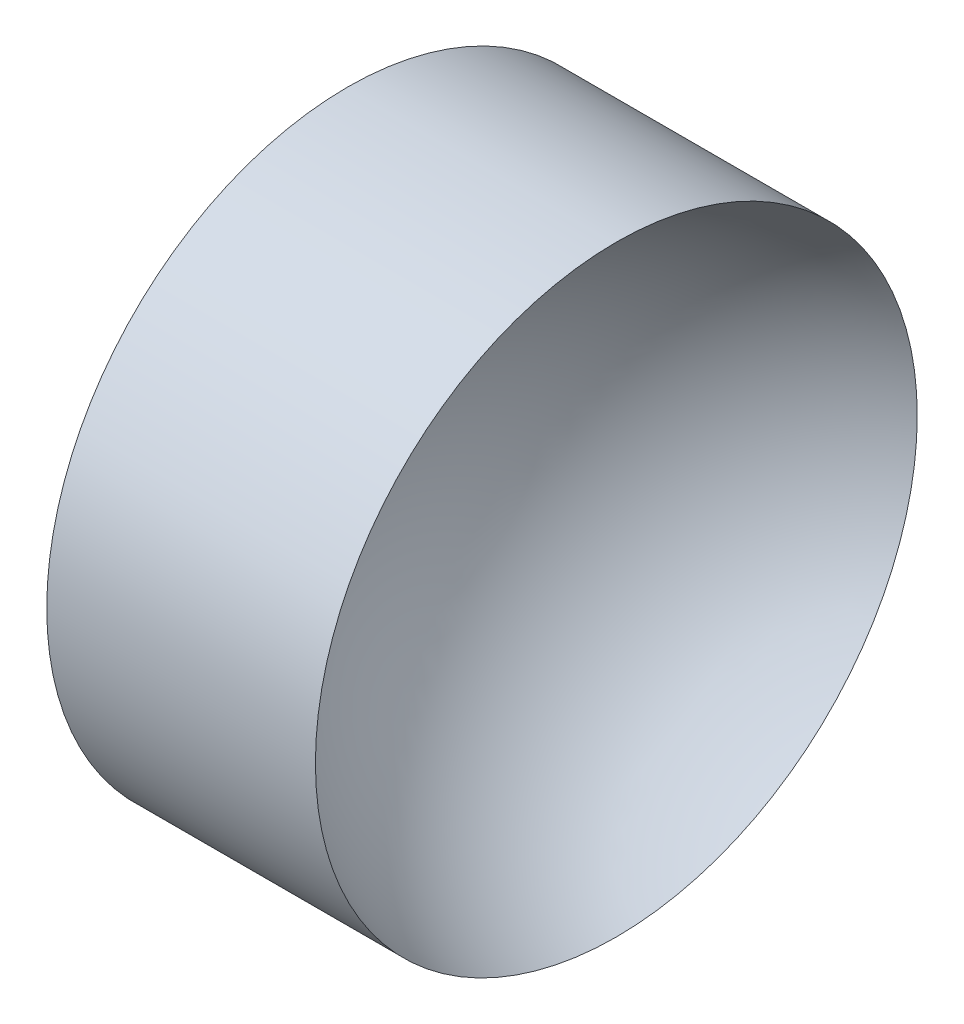
ISO-10303-21;
HEADER;
FILE_DESCRIPTION(('STEP AP214'),'2;1');
FILE_NAME('part.step','',(''),(''),'','','');
FILE_SCHEMA(('AUTOMOTIVE_DESIGN { 1 0 10303 214 1 1 1 1 }'));
ENDSEC;
DATA;
#1=APPLICATION_CONTEXT('core data for automotive mechanical design processes');
#2=APPLICATION_PROTOCOL_DEFINITION('international standard','automotive_design',2000,#1);
#3=PRODUCT_CONTEXT('',#1,'mechanical');
#4=PRODUCT('Part','Part','',(#3));
#5=PRODUCT_RELATED_PRODUCT_CATEGORY('part','',(#4));
#6=PRODUCT_DEFINITION_FORMATION('','',#4);
#7=PRODUCT_DEFINITION_CONTEXT('part definition',#1,'design');
#8=PRODUCT_DEFINITION('design','',#6,#7);
#9=PRODUCT_DEFINITION_SHAPE('','',#8);
#10=(LENGTH_UNIT() NAMED_UNIT(*) SI_UNIT(.MILLI.,.METRE.));
#11=(NAMED_UNIT(*) PLANE_ANGLE_UNIT() SI_UNIT($,.RADIAN.));
#12=(NAMED_UNIT(*) SI_UNIT($,.STERADIAN.) SOLID_ANGLE_UNIT());
#13=UNCERTAINTY_MEASURE_WITH_UNIT(LENGTH_MEASURE(1.E-05),#10,'distance_accuracy_value','');
#14=(GEOMETRIC_REPRESENTATION_CONTEXT(3) GLOBAL_UNCERTAINTY_ASSIGNED_CONTEXT((#13)) GLOBAL_UNIT_ASSIGNED_CONTEXT((#10,
#11,#12)) REPRESENTATION_CONTEXT('',''));
#15=CARTESIAN_POINT('',(0.,0.,0.));
#16=DIRECTION('',(0.,0.,1.));
#17=DIRECTION('',(1.,0.,0.));
#18=AXIS2_PLACEMENT_3D('',#15,#16,#17);
#19=CARTESIAN_POINT('',(72.6412671835305,32.6107681292268,0.));
#20=DIRECTION('',(-1.,0.,0.));
#21=DIRECTION('',(0.,-1.,0.));
#22=AXIS2_PLACEMENT_3D('',#19,#20,#21);
#23=SPHERICAL_SURFACE('',#22,13.1089301310044);
#24=CARTESIAN_POINT('',(68.6923370525261,32.6107681292268,0.));
#25=DIRECTION('',(-1.,0.,0.));
#26=DIRECTION('',(0.,0.,1.));
#27=AXIS2_PLACEMENT_3D('',#24,#25,#26);
#28=CIRCLE('',#27,12.5);
#29=CARTESIAN_POINT('',(68.6923370525261,32.6107681292268,12.5));
#30=VERTEX_POINT('',#29);
#31=EDGE_CURVE('E10',#30,#30,#28,.T.);
#32=ORIENTED_EDGE('',*,*,#31,.F.);
#33=EDGE_LOOP('',(#32));
#34=FACE_BOUND('',#33,.T.);
#35=ADVANCED_FACE('F35',(#34),#23,.F.);
#36=CARTESIAN_POINT('',(56.1009150799972,32.6107681292268,0.));
#37=DIRECTION('',(-1.,0.,0.));
#38=DIRECTION('',(0.,0.,1.));
#39=AXIS2_PLACEMENT_3D('',#36,#37,#38);
#40=CYLINDRICAL_SURFACE('',#39,12.5);
#41=CARTESIAN_POINT('',(57.5323370525261,32.6107681292268,0.));
#42=DIRECTION('',(-1.,0.,0.));
#43=DIRECTION('',(0.,0.,1.));
#44=AXIS2_PLACEMENT_3D('',#41,#42,#43);
#45=CIRCLE('',#44,12.5);
#46=CARTESIAN_POINT('',(57.5323370525261,32.6107681292268,12.5));
#47=VERTEX_POINT('',#46);
#48=EDGE_CURVE('E41',#47,#47,#45,.T.);
#49=ORIENTED_EDGE('',*,*,#48,.F.);
#50=EDGE_LOOP('',(#49));
#51=FACE_BOUND('',#50,.T.);
#52=ORIENTED_EDGE('',*,*,#31,.T.);
#53=EDGE_LOOP('',(#52));
#54=FACE_BOUND('',#53,.T.);
#55=ADVANCED_FACE('F49',(#51,#54),#40,.T.);
#56=CARTESIAN_POINT('',(57.5323370525261,32.6107681292268,0.));
#57=DIRECTION('',(1.,0.,0.));
#58=DIRECTION('',(0.,0.,-1.));
#59=AXIS2_PLACEMENT_3D('',#56,#57,#58);
#60=PLANE('',#59);
#61=ORIENTED_EDGE('',*,*,#48,.T.);
#62=EDGE_LOOP('',(#61));
#63=FACE_BOUND('',#62,.T.);
#64=ADVANCED_FACE('F47',(#63),#60,.F.);
#65=CLOSED_SHELL('',(#35,#55,#64));
#66=MANIFOLD_SOLID_BREP('B2',#65);
#67=ADVANCED_BREP_SHAPE_REPRESENTATION('',(#18,#66),#14);
#68=SHAPE_DEFINITION_REPRESENTATION(#9,#67);
ENDSEC;
END-ISO-10303-21;
